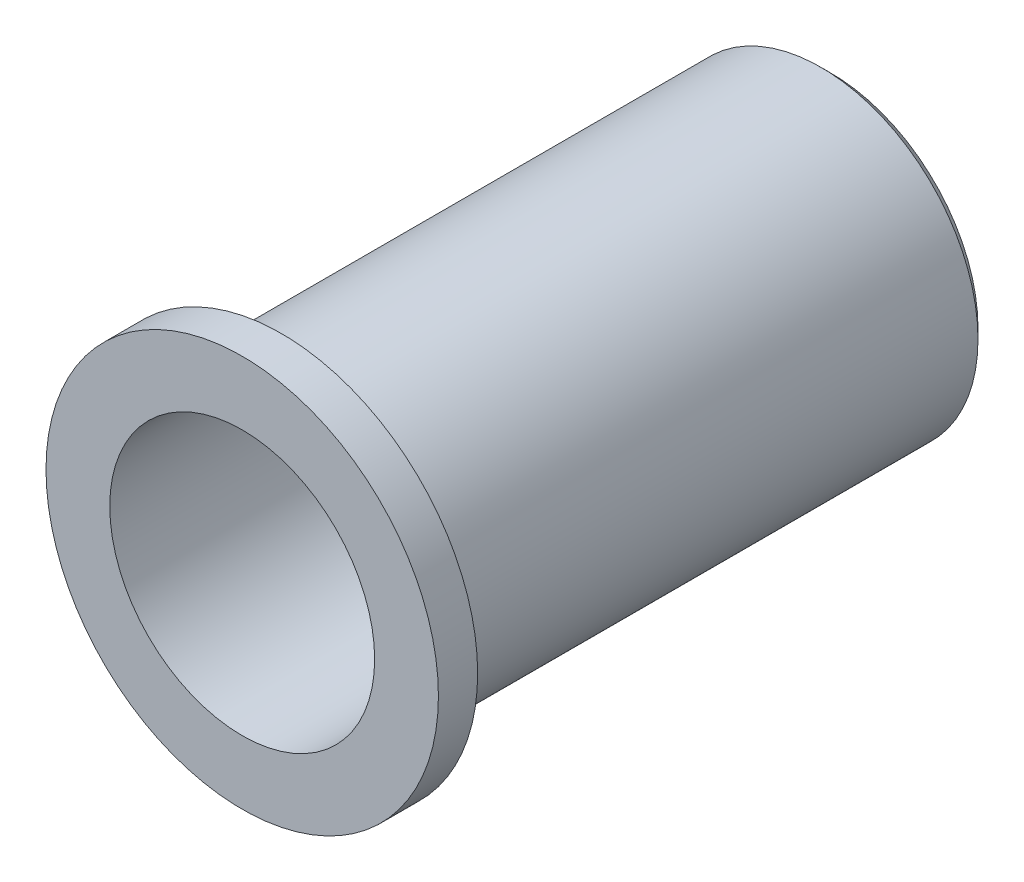
ISO-10303-21;
HEADER;
FILE_DESCRIPTION(('STEP AP214'),'2;1');
FILE_NAME('part.step','',(''),(''),'','','');
FILE_SCHEMA(('AUTOMOTIVE_DESIGN { 1 0 10303 214 1 1 1 1 }'));
ENDSEC;
DATA;
#1=APPLICATION_CONTEXT('core data for automotive mechanical design processes');
#2=APPLICATION_PROTOCOL_DEFINITION('international standard','automotive_design',2000,#1);
#3=PRODUCT_CONTEXT('',#1,'mechanical');
#4=PRODUCT('Part','Part','',(#3));
#5=PRODUCT_RELATED_PRODUCT_CATEGORY('part','',(#4));
#6=PRODUCT_DEFINITION_FORMATION('','',#4);
#7=PRODUCT_DEFINITION_CONTEXT('part definition',#1,'design');
#8=PRODUCT_DEFINITION('design','',#6,#7);
#9=PRODUCT_DEFINITION_SHAPE('','',#8);
#10=(LENGTH_UNIT() NAMED_UNIT(*) SI_UNIT(.MILLI.,.METRE.));
#11=(NAMED_UNIT(*) PLANE_ANGLE_UNIT() SI_UNIT($,.RADIAN.));
#12=(NAMED_UNIT(*) SI_UNIT($,.STERADIAN.) SOLID_ANGLE_UNIT());
#13=UNCERTAINTY_MEASURE_WITH_UNIT(LENGTH_MEASURE(1.E-05),#10,'distance_accuracy_value','');
#14=(GEOMETRIC_REPRESENTATION_CONTEXT(3) GLOBAL_UNCERTAINTY_ASSIGNED_CONTEXT((#13)) GLOBAL_UNIT_ASSIGNED_CONTEXT((#10,
#11,#12)) REPRESENTATION_CONTEXT('',''));
#15=CARTESIAN_POINT('',(0.,0.,0.));
#16=DIRECTION('',(0.,0.,1.));
#17=DIRECTION('',(1.,0.,0.));
#18=AXIS2_PLACEMENT_3D('',#15,#16,#17);
#19=CARTESIAN_POINT('',(0.,0.,12.));
#20=DIRECTION('',(0.,0.,-1.));
#21=DIRECTION('',(-1.,0.,0.));
#22=AXIS2_PLACEMENT_3D('',#19,#20,#21);
#23=CYLINDRICAL_SURFACE('',#22,4.);
#24=CARTESIAN_POINT('',(0.,0.,12.));
#25=DIRECTION('',(0.,0.,1.));
#26=DIRECTION('',(1.,0.,0.));
#27=AXIS2_PLACEMENT_3D('',#24,#25,#26);
#28=CIRCLE('',#27,4.);
#29=CARTESIAN_POINT('',(4.,0.,12.));
#30=VERTEX_POINT('',#29);
#31=EDGE_CURVE('E44',#30,#30,#28,.T.);
#32=ORIENTED_EDGE('',*,*,#31,.F.);
#33=EDGE_LOOP('',(#32));
#34=FACE_BOUND('',#33,.T.);
#35=CARTESIAN_POINT('',(0.,0.,11.2));
#36=DIRECTION('',(0.,0.,-1.));
#37=DIRECTION('',(-1.,0.,0.));
#38=AXIS2_PLACEMENT_3D('',#35,#36,#37);
#39=CIRCLE('',#38,4.);
#40=CARTESIAN_POINT('',(-4.,0.,11.2));
#41=VERTEX_POINT('',#40);
#42=EDGE_CURVE('E51',#41,#41,#39,.T.);
#43=ORIENTED_EDGE('',*,*,#42,.F.);
#44=EDGE_LOOP('',(#43));
#45=FACE_BOUND('',#44,.T.);
#46=ADVANCED_FACE('F33',(#34,#45),#23,.T.);
#47=CARTESIAN_POINT('',(0.,0.,12.));
#48=DIRECTION('',(0.,0.,1.));
#49=DIRECTION('',(1.,0.,0.));
#50=AXIS2_PLACEMENT_3D('',#47,#48,#49);
#51=PLANE('',#50);
#52=CARTESIAN_POINT('',(0.,0.,12.));
#53=DIRECTION('',(0.,0.,1.));
#54=DIRECTION('',(1.,0.,0.));
#55=AXIS2_PLACEMENT_3D('',#52,#53,#54);
#56=CIRCLE('',#55,2.7);
#57=CARTESIAN_POINT('',(2.7,0.,12.));
#58=VERTEX_POINT('',#57);
#59=EDGE_CURVE('E53',#58,#58,#56,.T.);
#60=ORIENTED_EDGE('',*,*,#59,.F.);
#61=EDGE_LOOP('',(#60));
#62=FACE_BOUND('',#61,.T.);
#63=ORIENTED_EDGE('',*,*,#31,.T.);
#64=EDGE_LOOP('',(#63));
#65=FACE_BOUND('',#64,.T.);
#66=ADVANCED_FACE('F85',(#62,#65),#51,.T.);
#67=CARTESIAN_POINT('',(0.,0.,7.8));
#68=DIRECTION('',(0.,0.,1.));
#69=DIRECTION('',(1.,0.,0.));
#70=AXIS2_PLACEMENT_3D('',#67,#68,#69);
#71=CYLINDRICAL_SURFACE('',#70,2.7);
#72=CARTESIAN_POINT('',(0.,0.,7.8));
#73=DIRECTION('',(0.,0.,1.));
#74=DIRECTION('',(1.,0.,0.));
#75=AXIS2_PLACEMENT_3D('',#72,#73,#74);
#76=CIRCLE('',#75,2.7);
#77=CARTESIAN_POINT('',(2.7,0.,7.8));
#78=VERTEX_POINT('',#77);
#79=EDGE_CURVE('E48',#78,#78,#76,.T.);
#80=ORIENTED_EDGE('',*,*,#79,.F.);
#81=EDGE_LOOP('',(#80));
#82=FACE_BOUND('',#81,.T.);
#83=ORIENTED_EDGE('',*,*,#59,.T.);
#84=EDGE_LOOP('',(#83));
#85=FACE_BOUND('',#84,.T.);
#86=ADVANCED_FACE('F90',(#82,#85),#71,.F.);
#87=CARTESIAN_POINT('',(0.,0.,7.8));
#88=DIRECTION('',(0.,0.,1.));
#89=DIRECTION('',(1.,0.,0.));
#90=AXIS2_PLACEMENT_3D('',#87,#88,#89);
#91=PLANE('',#90);
#92=CARTESIAN_POINT('',(0.,0.,7.8));
#93=DIRECTION('',(0.,0.,1.));
#94=DIRECTION('',(1.,0.,0.));
#95=AXIS2_PLACEMENT_3D('',#92,#93,#94);
#96=CIRCLE('',#95,1.6);
#97=CARTESIAN_POINT('',(1.6,0.,7.8));
#98=VERTEX_POINT('',#97);
#99=EDGE_CURVE('E62',#98,#98,#96,.T.);
#100=ORIENTED_EDGE('',*,*,#99,.F.);
#101=EDGE_LOOP('',(#100));
#102=FACE_BOUND('',#101,.T.);
#103=ORIENTED_EDGE('',*,*,#79,.T.);
#104=EDGE_LOOP('',(#103));
#105=FACE_BOUND('',#104,.T.);
#106=ADVANCED_FACE('F97',(#102,#105),#91,.T.);
#107=CARTESIAN_POINT('',(0.,0.,11.2));
#108=DIRECTION('',(0.,0.,-1.));
#109=DIRECTION('',(-1.,0.,0.));
#110=AXIS2_PLACEMENT_3D('',#107,#108,#109);
#111=PLANE('',#110);
#112=CARTESIAN_POINT('',(0.,0.,11.2));
#113=DIRECTION('',(0.,0.,-1.));
#114=DIRECTION('',(-1.,0.,0.));
#115=AXIS2_PLACEMENT_3D('',#112,#113,#114);
#116=CIRCLE('',#115,3.2);
#117=CARTESIAN_POINT('',(-3.2,0.,11.2));
#118=VERTEX_POINT('',#117);
#119=EDGE_CURVE('E54',#118,#118,#116,.T.);
#120=ORIENTED_EDGE('',*,*,#119,.F.);
#121=EDGE_LOOP('',(#120));
#122=FACE_BOUND('',#121,.T.);
#123=ORIENTED_EDGE('',*,*,#42,.T.);
#124=EDGE_LOOP('',(#123));
#125=FACE_BOUND('',#124,.T.);
#126=ADVANCED_FACE('F81',(#122,#125),#111,.T.);
#127=CARTESIAN_POINT('',(0.,0.,11.2));
#128=DIRECTION('',(0.,0.,-1.));
#129=DIRECTION('',(-1.,0.,0.));
#130=AXIS2_PLACEMENT_3D('',#127,#128,#129);
#131=CYLINDRICAL_SURFACE('',#130,3.2);
#132=CARTESIAN_POINT('',(0.,0.,0.199999999999999));
#133=DIRECTION('',(0.,0.,1.));
#134=DIRECTION('',(1.,0.,0.));
#135=AXIS2_PLACEMENT_3D('',#132,#133,#134);
#136=CIRCLE('',#135,3.2);
#137=CARTESIAN_POINT('',(3.2,0.,0.199999999999999));
#138=VERTEX_POINT('',#137);
#139=EDGE_CURVE('E11',#138,#138,#136,.T.);
#140=ORIENTED_EDGE('',*,*,#139,.T.);
#141=EDGE_LOOP('',(#140));
#142=FACE_BOUND('',#141,.T.);
#143=ORIENTED_EDGE('',*,*,#119,.T.);
#144=EDGE_LOOP('',(#143));
#145=FACE_BOUND('',#144,.T.);
#146=ADVANCED_FACE('F73',(#142,#145),#131,.T.);
#147=CARTESIAN_POINT('',(0.,0.,0.));
#148=DIRECTION('',(0.,0.,1.));
#149=DIRECTION('',(1.,0.,0.));
#150=AXIS2_PLACEMENT_3D('',#147,#148,#149);
#151=PLANE('',#150);
#152=CARTESIAN_POINT('',(0.,0.,0.));
#153=DIRECTION('',(0.,0.,1.));
#154=DIRECTION('',(1.,0.,0.));
#155=AXIS2_PLACEMENT_3D('',#152,#153,#154);
#156=CIRCLE('',#155,3.);
#157=CARTESIAN_POINT('',(3.,0.,0.));
#158=VERTEX_POINT('',#157);
#159=EDGE_CURVE('E40',#158,#158,#156,.F.);
#160=ORIENTED_EDGE('',*,*,#159,.T.);
#161=EDGE_LOOP('',(#160));
#162=FACE_BOUND('',#161,.T.);
#163=CARTESIAN_POINT('',(0.,0.,0.));
#164=DIRECTION('',(0.,0.,-1.));
#165=DIRECTION('',(-1.,0.,0.));
#166=AXIS2_PLACEMENT_3D('',#163,#164,#165);
#167=CIRCLE('',#166,1.6);
#168=CARTESIAN_POINT('',(-1.6,0.,0.));
#169=VERTEX_POINT('',#168);
#170=EDGE_CURVE('E65',#169,#169,#167,.T.);
#171=ORIENTED_EDGE('',*,*,#170,.F.);
#172=EDGE_LOOP('',(#171));
#173=FACE_BOUND('',#172,.T.);
#174=ADVANCED_FACE('F71',(#162,#173),#151,.F.);
#175=CARTESIAN_POINT('',(0.,0.,11.2));
#176=DIRECTION('',(0.,0.,-1.));
#177=DIRECTION('',(-1.,0.,0.));
#178=AXIS2_PLACEMENT_3D('',#175,#176,#177);
#179=CYLINDRICAL_SURFACE('',#178,1.6);
#180=ORIENTED_EDGE('',*,*,#99,.T.);
#181=EDGE_LOOP('',(#180));
#182=FACE_BOUND('',#181,.T.);
#183=ORIENTED_EDGE('',*,*,#170,.T.);
#184=EDGE_LOOP('',(#183));
#185=FACE_BOUND('',#184,.T.);
#186=ADVANCED_FACE('F69',(#182,#185),#179,.F.);
#187=CARTESIAN_POINT('',(0.,0.,0.));
#188=DIRECTION('',(0.,0.,1.));
#189=DIRECTION('',(1.,0.,0.));
#190=AXIS2_PLACEMENT_3D('',#187,#188,#189);
#191=CONICAL_SURFACE('',#190,3.,0.785398163397449);
#192=ORIENTED_EDGE('',*,*,#139,.F.);
#193=EDGE_LOOP('',(#192));
#194=FACE_BOUND('',#193,.T.);
#195=ORIENTED_EDGE('',*,*,#159,.F.);
#196=EDGE_LOOP('',(#195));
#197=FACE_BOUND('',#196,.T.);
#198=ADVANCED_FACE('F35',(#194,#197),#191,.T.);
#199=CLOSED_SHELL('',(#46,#66,#86,#106,#126,#146,#174,#186,#198));
#200=MANIFOLD_SOLID_BREP('B2',#199);
#201=ADVANCED_BREP_SHAPE_REPRESENTATION('',(#18,#200),#14);
#202=SHAPE_DEFINITION_REPRESENTATION(#9,#201);
ENDSEC;
END-ISO-10303-21;
